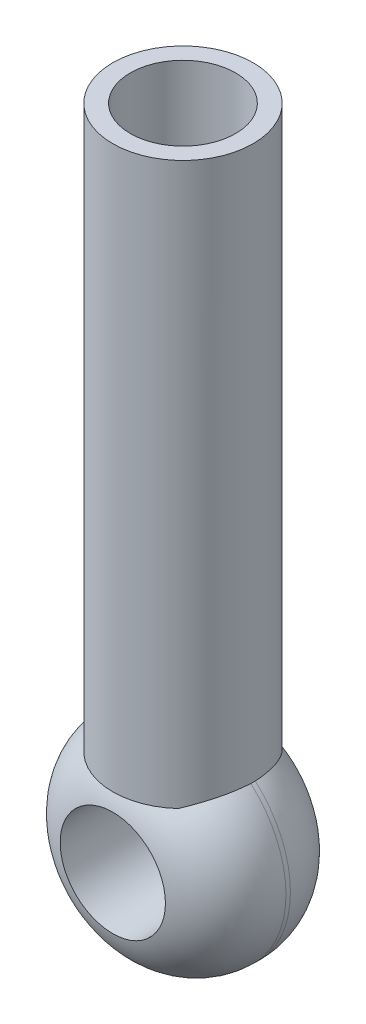
ISO-10303-21;
HEADER;
FILE_DESCRIPTION(('STEP AP214'),'2;1');
FILE_NAME('part.step','',(''),(''),'','','');
FILE_SCHEMA(('AUTOMOTIVE_DESIGN { 1 0 10303 214 1 1 1 1 }'));
ENDSEC;
DATA;
#1=APPLICATION_CONTEXT('core data for automotive mechanical design processes');
#2=APPLICATION_PROTOCOL_DEFINITION('international standard','automotive_design',2000,#1);
#3=PRODUCT_CONTEXT('',#1,'mechanical');
#4=PRODUCT('Part','Part','',(#3));
#5=PRODUCT_RELATED_PRODUCT_CATEGORY('part','',(#4));
#6=PRODUCT_DEFINITION_FORMATION('','',#4);
#7=PRODUCT_DEFINITION_CONTEXT('part definition',#1,'design');
#8=PRODUCT_DEFINITION('design','',#6,#7);
#9=PRODUCT_DEFINITION_SHAPE('','',#8);
#10=(LENGTH_UNIT() NAMED_UNIT(*) SI_UNIT(.MILLI.,.METRE.));
#11=(NAMED_UNIT(*) PLANE_ANGLE_UNIT() SI_UNIT($,.RADIAN.));
#12=(NAMED_UNIT(*) SI_UNIT($,.STERADIAN.) SOLID_ANGLE_UNIT());
#13=UNCERTAINTY_MEASURE_WITH_UNIT(LENGTH_MEASURE(1.E-05),#10,'distance_accuracy_value','');
#14=(GEOMETRIC_REPRESENTATION_CONTEXT(3) GLOBAL_UNCERTAINTY_ASSIGNED_CONTEXT((#13)) GLOBAL_UNIT_ASSIGNED_CONTEXT((#10,
#11,#12)) REPRESENTATION_CONTEXT('',''));
#15=CARTESIAN_POINT('',(0.,0.,0.));
#16=DIRECTION('',(0.,0.,1.));
#17=DIRECTION('',(1.,0.,0.));
#18=AXIS2_PLACEMENT_3D('',#15,#16,#17);
#19=CARTESIAN_POINT('',(0.,0.,20.));
#20=DIRECTION('',(0.,0.,-1.));
#21=DIRECTION('',(-1.,0.,0.));
#22=AXIS2_PLACEMENT_3D('',#19,#20,#21);
#23=CYLINDRICAL_SURFACE('',#22,15.);
#24=CARTESIAN_POINT('',(9.99495709397349,11.184848353448,10.3175416344815));
#25=CARTESIAN_POINT('',(9.9983190313245,11.181842709482,10.2116944229876));
#26=CARTESIAN_POINT('',(10.,11.180339887499,10.1058472114938));
#27=CARTESIAN_POINT('',(10.,11.180339887499,9.89415278850618));
#28=CARTESIAN_POINT('',(9.9983190313245,11.181842709482,9.78830557701236));
#29=CARTESIAN_POINT('',(9.99495709397349,11.184848353448,9.68245836551854));
#30=B_SPLINE_CURVE_WITH_KNOTS('',3,(#24,#25,#26,#27,#28,#29),.UNSPECIFIED.,.F.,.F.,(4,2,4),(0.,
0.317613675391285,0.635227350782569),.UNSPECIFIED.);
#31=CARTESIAN_POINT('',(9.99495709397349,11.184848353448,10.3175416344815));
#32=VERTEX_POINT('',#31);
#33=CARTESIAN_POINT('',(9.99495709397349,11.184848353448,9.68245836551854));
#34=VERTEX_POINT('',#33);
#35=EDGE_CURVE('E72',#32,#34,#30,.T.);
#36=ORIENTED_EDGE('',*,*,#35,.F.);
#37=CARTESIAN_POINT('',(0.,0.,10.3175416344815));
#38=DIRECTION('',(0.,0.,1.));
#39=DIRECTION('',(1.,0.,0.));
#40=AXIS2_PLACEMENT_3D('',#37,#38,#39);
#41=CIRCLE('',#40,15.);
#42=CARTESIAN_POINT('',(-9.99495709397349,11.184848353448,10.3175416344815));
#43=VERTEX_POINT('',#42);
#44=EDGE_CURVE('E104',#32,#43,#41,.F.);
#45=ORIENTED_EDGE('',*,*,#44,.T.);
#46=CARTESIAN_POINT('',(-9.99495709397349,11.184848353448,9.68245836551854));
#47=CARTESIAN_POINT('',(-9.9983190313245,11.181842709482,9.78830557701236));
#48=CARTESIAN_POINT('',(-10.,11.180339887499,9.89415278850618));
#49=CARTESIAN_POINT('',(-10.,11.180339887499,10.1058472114938));
#50=CARTESIAN_POINT('',(-9.9983190313245,11.181842709482,10.2116944229876));
#51=CARTESIAN_POINT('',(-9.99495709397349,11.184848353448,10.3175416344815));
#52=B_SPLINE_CURVE_WITH_KNOTS('',3,(#46,#47,#48,#49,#50,#51),.UNSPECIFIED.,.F.,.F.,(4,2,4),(0.,
0.317613675391285,0.635227350782569),.UNSPECIFIED.);
#53=CARTESIAN_POINT('',(-9.99495709397349,11.184848353448,9.68245836551854));
#54=VERTEX_POINT('',#53);
#55=EDGE_CURVE('E144',#54,#43,#52,.T.);
#56=ORIENTED_EDGE('',*,*,#55,.F.);
#57=CARTESIAN_POINT('',(0.,0.,9.68245836551854));
#58=DIRECTION('',(0.,0.,-1.));
#59=DIRECTION('',(-1.,0.,0.));
#60=AXIS2_PLACEMENT_3D('',#57,#58,#59);
#61=CIRCLE('',#60,15.);
#62=EDGE_CURVE('E94',#54,#34,#61,.F.);
#63=ORIENTED_EDGE('',*,*,#62,.T.);
#64=EDGE_LOOP('',(#36,#45,#56,#63));
#65=FACE_BOUND('',#64,.T.);
#66=ADVANCED_FACE('F43',(#65),#23,.T.);
#67=CARTESIAN_POINT('',(0.,0.,9.68245836551854));
#68=DIRECTION('',(0.,0.,-1.));
#69=DIRECTION('',(-1.,0.,0.));
#70=AXIS2_PLACEMENT_3D('',#67,#68,#69);
#71=DEGENERATE_TOROIDAL_SURFACE('',#70,5.,10.,.T.);
#72=CARTESIAN_POINT('',(0.,0.,0.));
#73=DIRECTION('',(0.,0.,1.));
#74=DIRECTION('',(1.,0.,0.));
#75=AXIS2_PLACEMENT_3D('',#72,#73,#74);
#76=CIRCLE('',#75,7.5);
#77=CARTESIAN_POINT('',(7.5,0.,0.));
#78=VERTEX_POINT('',#77);
#79=EDGE_CURVE('E115',#78,#78,#76,.T.);
#80=ORIENTED_EDGE('',*,*,#79,.T.);
#81=EDGE_LOOP('',(#80));
#82=FACE_BOUND('',#81,.T.);
#83=ORIENTED_EDGE('',*,*,#62,.F.);
#84=CARTESIAN_POINT('',(-9.99496344600743,11.1848426744848,9.68265836551855));
#85=CARTESIAN_POINT('',(-9.98671786566399,11.1922602757333,9.42169018971652));
#86=CARTESIAN_POINT('',(-9.96816907643758,11.1950858327142,9.16092715337411));
#87=CARTESIAN_POINT('',(-9.91075791175284,11.1916394674072,8.64174222547384));
#88=CARTESIAN_POINT('',(-9.87189831444325,11.1853687891103,8.38332001864989));
#89=CARTESIAN_POINT('',(-9.7742863833289,11.1638473013504,7.87135930206357));
#90=CARTESIAN_POINT('',(-9.71558741779881,11.1486205035146,7.6178095989937));
#91=CARTESIAN_POINT('',(-9.57883007494955,11.1093381040931,7.11669387969464));
#92=CARTESIAN_POINT('',(-9.50077196860422,11.085282626082,6.86912777976496));
#93=CARTESIAN_POINT('',(-9.32601525194219,11.0285034785032,6.38164389724023));
#94=CARTESIAN_POINT('',(-9.2293133626598,10.9957782837742,6.14172746868982));
#95=CARTESIAN_POINT('',(-9.01819073639723,10.9218639944428,5.6711732797249));
#96=CARTESIAN_POINT('',(-8.90376937691506,10.8806746024684,5.44053584564912));
#97=CARTESIAN_POINT('',(-8.65825935101766,10.7900653880867,4.98997373122002));
#98=CARTESIAN_POINT('',(-8.52716923399135,10.7406448492417,4.7700499855401));
#99=CARTESIAN_POINT('',(-8.24957380029892,10.6338740558408,4.34230136331528));
#100=CARTESIAN_POINT('',(-8.1030721499961,10.5765256862799,4.13447362735317));
#101=CARTESIAN_POINT('',(-7.76107553566134,10.4403310919475,3.68636089229922));
#102=CARTESIAN_POINT('',(-7.56199535959246,10.3595566492704,3.44937180964414));
#103=CARTESIAN_POINT('',(-7.24956123121886,10.2304259872081,3.11033647226274));
#104=CARTESIAN_POINT('',(-7.14321950229168,10.1860991799837,3.00016091176216));
#105=CARTESIAN_POINT('',(-6.9261759503583,10.0948644813799,2.78533552319565));
#106=CARTESIAN_POINT('',(-6.81547460178355,10.0479568706346,2.68068509674746));
#107=CARTESIAN_POINT('',(-6.70272768216613,9.9998,2.57885173179218));
#108=B_SPLINE_CURVE_WITH_KNOTS('',3,(#84,#85,#86,#87,#88,#89,#90,#91,#92,#93,#94,#95,#96,#97,
#98,#99,#100,#101,#102,#103,#104,#105,#106,#107),.UNSPECIFIED.,.F.,.F.,(4,2,2,2,2,2,2,2,2,2,2,
4),(0.,0.783356544086545,1.56660596729071,2.3477649857624,3.1289130708089,3.91019866540339,
4.69151171353899,5.47289280262134,6.25408842177927,7.21204052490003,7.69012820904673,
8.16816400874945),.UNSPECIFIED.);
#109=CARTESIAN_POINT('',(-6.70319595067423,10.,2.57927469536403));
#110=VERTEX_POINT('',#109);
#111=EDGE_CURVE('E161',#54,#110,#108,.T.);
#112=ORIENTED_EDGE('',*,*,#111,.T.);
#113=CARTESIAN_POINT('',(0.,10.,1.02220432767416));
#114=CARTESIAN_POINT('',(0.228184911378586,10.,1.02220593443839));
#115=CARTESIAN_POINT('',(0.456361512835846,10.,1.02670638081143));
#116=CARTESIAN_POINT('',(0.912356264782832,10.,1.0447950820463));
#117=CARTESIAN_POINT('',(1.14017439442626,10.,1.05838384717136));
#118=CARTESIAN_POINT('',(1.82270793061155,10.,1.11310436761138));
#119=CARTESIAN_POINT('',(2.27641389943107,10.,1.16819048743379));
#120=CARTESIAN_POINT('',(3.17587343005349,10.,1.31863603607809));
#121=CARTESIAN_POINT('',(3.62164541650951,10.,1.41388439569447));
#122=CARTESIAN_POINT('',(4.50113034575016,10.,1.64914059446113));
#123=CARTESIAN_POINT('',(4.93485392981718,10.,1.78910747699373));
#124=CARTESIAN_POINT('',(5.6123543484195,10.,2.05183419051931));
#125=CARTESIAN_POINT('',(5.86230112349569,10.,2.158833740643));
#126=CARTESIAN_POINT('',(6.35354668965034,10.,2.39106063231422));
#127=CARTESIAN_POINT('',(6.59484823608554,10.,2.51628210070246));
#128=CARTESIAN_POINT('',(7.06671540543503,10.,2.78541904456307));
#129=CARTESIAN_POINT('',(7.2972847006834,10.,2.9293280607423));
#130=CARTESIAN_POINT('',(7.74554082249349,10.,3.23605172437001));
#131=CARTESIAN_POINT('',(7.96322731821896,10.,3.39886685701854));
#132=CARTESIAN_POINT('',(8.38524455389905,10.,3.74476313047858));
#133=CARTESIAN_POINT('',(8.58943525527278,10.,3.9280156831348));
#134=CARTESIAN_POINT('',(8.97974822155679,10.,4.31290654605334));
#135=CARTESIAN_POINT('',(9.16586996334072,10.,4.5145453883017));
#136=CARTESIAN_POINT('',(9.51747937278361,10.,4.9350083220509));
#137=CARTESIAN_POINT('',(9.68297324091699,10.,5.15382721705752));
#138=CARTESIAN_POINT('',(9.99097910132118,10.,5.60708110277051));
#139=CARTESIAN_POINT('',(10.1334949325154,10.,5.84151347567757));
#140=CARTESIAN_POINT('',(10.3764496125823,10.,6.2925036411226));
#141=CARTESIAN_POINT('',(10.4799507467106,10.,6.50741636611151));
#142=CARTESIAN_POINT('',(10.6666737904827,10.,6.94587524319575));
#143=CARTESIAN_POINT('',(10.7498978753941,10.,7.16942046623639));
#144=CARTESIAN_POINT('',(10.8949864106893,10.,7.62320908490967));
#145=CARTESIAN_POINT('',(10.9568624249938,10.,7.85344878072783));
#146=CARTESIAN_POINT('',(11.0585181780084,10.,8.31875479662081));
#147=CARTESIAN_POINT('',(11.0982994218175,10.,8.55382078679628));
#148=CARTESIAN_POINT('',(11.1524887157037,10.,9.00372708492306));
#149=CARTESIAN_POINT('',(11.1689828940319,10.,9.21831865408176));
#150=CARTESIAN_POINT('',(11.1833606123922,10.,9.64812007382018));
#151=CARTESIAN_POINT('',(11.1812451543646,10.,9.86332989048989));
#152=CARTESIAN_POINT('',(11.1584295842413,10.,10.29270843567));
#153=CARTESIAN_POINT('',(11.1377338174454,10.,10.5068773958277));
#154=CARTESIAN_POINT('',(11.0779865315856,10.,10.9326395749265));
#155=CARTESIAN_POINT('',(11.038934914454,10.,11.1442327801004));
#156=CARTESIAN_POINT('',(10.9440277556455,10.,11.5583537422234));
#157=CARTESIAN_POINT('',(10.8885904908162,10.,11.7609775970696));
#158=CARTESIAN_POINT('',(10.7611481354538,10.,12.1610164430484));
#159=CARTESIAN_POINT('',(10.6891375077889,10.,12.3584296686928));
#160=CARTESIAN_POINT('',(10.529295533541,10.,12.7466434292682));
#161=CARTESIAN_POINT('',(10.4414705388769,10.,12.9374465826121));
#162=CARTESIAN_POINT('',(10.2507745202556,10.,13.3114739054499));
#163=CARTESIAN_POINT('',(10.1478969322421,10.,13.494694723534));
#164=CARTESIAN_POINT('',(9.92447387895717,10.,13.8583257653615));
#165=CARTESIAN_POINT('',(9.80346107692485,10.,14.0384487026991));
#166=CARTESIAN_POINT('',(9.54760580287419,10.,14.3884766927462));
#167=CARTESIAN_POINT('',(9.41276805298186,10.,14.5583852031039));
#168=CARTESIAN_POINT('',(9.13035313519826,10.,14.8874022738347));
#169=CARTESIAN_POINT('',(8.98276930590829,10.,15.0465051083668));
#170=CARTESIAN_POINT('',(8.67620066676089,10.,15.3532239908594));
#171=CARTESIAN_POINT('',(8.51721833321982,10.,15.5008425193336));
#172=CARTESIAN_POINT('',(8.17402001415071,10.,15.7972616200632));
#173=CARTESIAN_POINT('',(7.98882676860093,10.,15.9449305938168));
#174=CARTESIAN_POINT('',(7.60790022793673,10.,16.22594932625));
#175=CARTESIAN_POINT('',(7.41216656852636,10.,16.3592985895367));
#176=CARTESIAN_POINT('',(7.01172225229886,10.,16.6116553436292));
#177=CARTESIAN_POINT('',(6.80701296567608,10.,16.7306650131528));
#178=CARTESIAN_POINT('',(6.3900085117721,10.,16.954584061041));
#179=CARTESIAN_POINT('',(6.17771178377142,10.,17.0594905170289));
#180=CARTESIAN_POINT('',(5.63255324854738,10.,17.3075732086158));
#181=CARTESIAN_POINT('',(5.29546967416344,10.,17.4415337920882));
#182=CARTESIAN_POINT('',(4.61077194539427,10.,17.679160388845));
#183=CARTESIAN_POINT('',(4.26315310086176,10.,17.7828126840164));
#184=CARTESIAN_POINT('',(3.55946083537265,10.,17.9624257097318));
#185=CARTESIAN_POINT('',(3.20335972059636,10.,18.0382768256573));
#186=CARTESIAN_POINT('',(2.48664900004959,10.,18.1640076964507));
#187=CARTESIAN_POINT('',(2.12603943676951,10.,18.2138876958978));
#188=CARTESIAN_POINT('',(1.53049025184471,10.,18.2761201323106));
#189=CARTESIAN_POINT('',(1.29625267175929,10.,18.2955065482169));
#190=CARTESIAN_POINT('',(0.827155542843944,10.,18.32453264717));
#191=CARTESIAN_POINT('',(0.592295962979869,10.,18.3341718343383));
#192=CARTESIAN_POINT('',(0.122281519731942,10.,18.3438788731717));
#193=CARTESIAN_POINT('',(-0.112873427265454,10.,18.3439426004716));
#194=CARTESIAN_POINT('',(-0.582990128215762,10.,18.3344894792061));
#195=CARTESIAN_POINT('',(-0.817951882452919,10.,18.324972644762));
#196=CARTESIAN_POINT('',(-1.28680037957453,10.,18.2962157023187));
#197=CARTESIAN_POINT('',(-1.52068834228798,10.,18.276995894611));
#198=CARTESIAN_POINT('',(-1.98742340498473,10.,18.2285147470685));
#199=CARTESIAN_POINT('',(-2.22027037904179,10.,18.1992522239945));
#200=CARTESIAN_POINT('',(-2.91618515814013,10.,18.0957616084612));
#201=CARTESIAN_POINT('',(-3.37710727163384,10.,18.0058028696554));
#202=CARTESIAN_POINT('',(-4.12383726880842,10.,17.8199815687846));
#203=CARTESIAN_POINT('',(-4.41311331823179,10.,17.7378296192961));
#204=CARTESIAN_POINT('',(-4.98503409205493,10.,17.5530546218688));
#205=CARTESIAN_POINT('',(-5.26768082578432,10.,17.4504378687701));
#206=CARTESIAN_POINT('',(-5.82370555422569,10.,17.2237328176586));
#207=CARTESIAN_POINT('',(-6.09709852829454,10.,17.099681421206));
#208=CARTESIAN_POINT('',(-6.63254131423592,10.,16.8290775015625));
#209=CARTESIAN_POINT('',(-6.89459288558627,10.,16.6825284847545));
#210=CARTESIAN_POINT('',(-7.3623765154237,10.,16.3925415588841));
#211=CARTESIAN_POINT('',(-7.57026634691483,10.,16.2525810030849));
#212=CARTESIAN_POINT('',(-7.974296338439,10.,15.9566439867188));
#213=CARTESIAN_POINT('',(-8.17043885482274,10.,15.8006707552268));
#214=CARTESIAN_POINT('',(-8.54919556374907,10.,15.4728963771465));
#215=CARTESIAN_POINT('',(-8.73180408522973,10.,15.301088662434));
#216=CARTESIAN_POINT('',(-9.0814814674595,10.,14.9422886078762));
#217=CARTESIAN_POINT('',(-9.24855007679491,10.,14.7552960224529));
#218=CARTESIAN_POINT('',(-9.56623126955863,10.,14.3658369853666));
#219=CARTESIAN_POINT('',(-9.7167345484107,10.,14.1632811772351));
#220=CARTESIAN_POINT('',(-9.99822663235678,10.,13.7450036511074));
#221=CARTESIAN_POINT('',(-10.1292149680098,10.,13.5292816165675));
#222=CARTESIAN_POINT('',(-10.3699137012631,10.,13.0863861066141));
#223=CARTESIAN_POINT('',(-10.4796336973848,10.,12.8592178555382));
#224=CARTESIAN_POINT('',(-10.6763674703578,10.,12.3952589373693));
#225=CARTESIAN_POINT('',(-10.7633840692392,10.,12.1584694704254));
#226=CARTESIAN_POINT('',(-10.9049929382295,10.,11.7046956958556));
#227=CARTESIAN_POINT('',(-10.9621413310876,10.,11.4885056896751));
#228=CARTESIAN_POINT('',(-11.0569912591373,10.,11.0519023361277));
#229=CARTESIAN_POINT('',(-11.0946940895144,10.,10.8314892710552));
#230=CARTESIAN_POINT('',(-11.1502096628533,10.,10.3882486162712));
#231=CARTESIAN_POINT('',(-11.1680291567166,10.,10.1654218720264));
#232=CARTESIAN_POINT('',(-11.1835936591473,10.,9.71906822180106));
#233=CARTESIAN_POINT('',(-11.1813391261405,10.,9.49554133192611));
#234=CARTESIAN_POINT('',(-11.1574755669173,10.,9.06213319524539));
#235=CARTESIAN_POINT('',(-11.1369609636427,10.,8.852190813572));
#236=CARTESIAN_POINT('',(-11.0782805339622,10.,8.43471619531411));
#237=CARTESIAN_POINT('',(-11.0401089047147,10.,8.2271847740753));
#238=CARTESIAN_POINT('',(-10.9465276860542,10.,7.81616213613481));
#239=CARTESIAN_POINT('',(-10.8911268868537,10.,7.61266891536217));
#240=CARTESIAN_POINT('',(-10.7636119622712,10.,7.21089530106314));
#241=CARTESIAN_POINT('',(-10.6914904692195,10.,7.01261724851491));
#242=CARTESIAN_POINT('',(-10.5308151741855,10.,6.62155747578958));
#243=CARTESIAN_POINT('',(-10.4421726044565,10.,6.4288122643307));
#244=CARTESIAN_POINT('',(-10.2496183782775,10.,6.05121017832857));
#245=CARTESIAN_POINT('',(-10.1457126162914,10.,5.86635029396938));
#246=CARTESIAN_POINT('',(-9.9235340525224,10.,5.5053877776923));
#247=CARTESIAN_POINT('',(-9.80525569468146,10.,5.32928856972896));
#248=CARTESIAN_POINT('',(-9.55545761841681,10.,4.98683040044326));
#249=CARTESIAN_POINT('',(-9.42394117121948,10.,4.82046904881824));
#250=CARTESIAN_POINT('',(-9.14042578645627,10.,4.48836920067566));
#251=CARTESIAN_POINT('',(-8.98766890775205,10.,4.32327791825825));
#252=CARTESIAN_POINT('',(-8.66987332201554,10.,4.00539816424218));
#253=CARTESIAN_POINT('',(-8.50483444285492,10.,3.85260986512842));
#254=CARTESIAN_POINT('',(-8.16380804510362,10.,3.55969342608737));
#255=CARTESIAN_POINT('',(-7.9878171921604,10.,3.41956917391382));
#256=CARTESIAN_POINT('',(-7.62628398297603,10.,3.15221696889244));
#257=CARTESIAN_POINT('',(-7.44073982854864,10.,3.02499145741121));
#258=CARTESIAN_POINT('',(-6.98602465088484,10.,2.73546364344642));
#259=CARTESIAN_POINT('',(-6.7129194142353,10.,2.57931074092619));
#260=CARTESIAN_POINT('',(-6.15396987002616,10.,2.29174729928855));
#261=CARTESIAN_POINT('',(-5.86812126022719,10.,2.1603451956265));
#262=CARTESIAN_POINT('',(-5.28645043357677,10.,1.92118679958738));
#263=CARTESIAN_POINT('',(-4.9906194851268,10.,1.81345186177644));
#264=CARTESIAN_POINT('',(-4.3917224791518,10.,1.62039682512617));
#265=CARTESIAN_POINT('',(-4.08865494613438,10.,1.53508134078147));
#266=CARTESIAN_POINT('',(-3.47433372856311,10.,1.38461240702548));
#267=CARTESIAN_POINT('',(-3.16302816066747,10.,1.31967257144775));
#268=CARTESIAN_POINT('',(-2.53696816926246,10.,1.20963012009678));
#269=CARTESIAN_POINT('',(-2.22221376785696,10.,1.16452737726206));
#270=CARTESIAN_POINT('',(-1.59005901643911,10.,1.09283387342807));
#271=CARTESIAN_POINT('',(-1.27265494113864,10.,1.06627636321906));
#272=CARTESIAN_POINT('',(-0.6368285847724,10.,1.03095955299553));
#273=CARTESIAN_POINT('',(-0.318406202244898,10.,1.02220208561663));
#274=CARTESIAN_POINT('',(0.,10.,1.02220432767416));
#275=B_SPLINE_CURVE_WITH_KNOTS('',3,(#113,#114,#115,#116,#117,#118,#119,#120,#121,#122,#123,
#124,#125,#126,#127,#128,#129,#130,#131,#132,#133,#134,#135,#136,#137,#138,#139,#140,#141,#142,
#143,#144,#145,#146,#147,#148,#149,#150,#151,#152,#153,#154,#155,#156,#157,#158,#159,#160,#161,
#162,#163,#164,#165,#166,#167,#168,#169,#170,#171,#172,#173,#174,#175,#176,#177,#178,#179,#180,
#181,#182,#183,#184,#185,#186,#187,#188,#189,#190,#191,#192,#193,#194,#195,#196,#197,#198,#199,
#200,#201,#202,#203,#204,#205,#206,#207,#208,#209,#210,#211,#212,#213,#214,#215,#216,#217,#218,
#219,#220,#221,#222,#223,#224,#225,#226,#227,#228,#229,#230,#231,#232,#233,#234,#235,#236,#237,
#238,#239,#240,#241,#242,#243,#244,#245,#246,#247,#248,#249,#250,#251,#252,#253,#254,#255,#256,
#257,#258,#259,#260,#261,#262,#263,#264,#265,#266,#267,#268,#269,#270,#271,#272,#273,#274),
.UNSPECIFIED.,.T.,.F.,(4,2,2,2,2,2,2,2,2,2,2,2,2,2,2,2,2,2,2,2,2,2,2,2,2,2,2,2,2,2,2,2,2,2,2,2,
2,2,2,2,2,2,2,2,2,2,2,2,2,2,2,2,2,2,2,2,2,2,2,2,2,2,2,2,2,2,2,2,2,2,2,2,2,2,2,2,2,2,2,2,4),(0.,
0.68448654187541,1.36901151744101,2.73832646607074,4.1038791389516,5.46818470312325,
6.28320568453337,7.09796455363902,7.91244254975279,8.72694145297026,9.548874609606,
10.3708315554778,11.1925408327315,12.0141126850595,12.7287495553852,13.4433097275879,
14.1574822236056,14.8716060641207,15.5164910261491,16.1613412678682,16.8060407404001,
17.4507436573288,18.0802331744468,18.7099333090051,19.3393810832763,19.9691041664713,
20.6193963583518,21.2694671681302,21.9198798001425,22.5701515561833,23.2800201693041,
23.9899133325457,24.699698500229,25.4096305190464,26.4961223680433,27.5831052255753,
28.6743288786398,29.7655422550833,30.4704740685975,31.1754417428671,31.8807130616547,
32.5859833409069,33.2897841506092,33.9936679110683,35.3999963415392,36.3015093693108,
37.2027455240682,38.102445307969,39.0020050105952,39.7531196891541,40.5040831962796,
41.2553596162654,42.0066481887232,42.7626294097449,43.5186288133101,44.2742862316491,
45.0298496770477,45.6998393615501,46.3697844151476,47.0395019359781,47.7092041626643,
48.3412834823295,48.9735706776022,49.6055358117448,50.237779940865,50.8735245298957,
51.5090242442459,52.1447704118957,52.780359866005,53.4544210753328,54.1284917331944,
54.8027686270027,55.4771729050242,56.4195507594999,57.36224921209,58.3057947867445,
59.2495344152705,60.202860749538,61.1561809774256,62.1112061082233,63.0663295603814),.UNSPECIFIED.);
#276=CARTESIAN_POINT('',(6.70319595067421,10.,2.57927469536401));
#277=VERTEX_POINT('',#276);
#278=EDGE_CURVE('E137',#110,#277,#275,.T.);
#279=ORIENTED_EDGE('',*,*,#278,.T.);
#280=CARTESIAN_POINT('',(6.70272768216613,9.9998,2.57885173179218));
#281=CARTESIAN_POINT('',(6.80862629601882,10.0450316066384,2.67449881356884));
#282=CARTESIAN_POINT('',(6.91272270071631,10.0891623802332,2.77263449174357));
#283=CARTESIAN_POINT('',(7.11708232620054,10.1751509690935,2.9737845228429));
#284=CARTESIAN_POINT('',(7.21734531256485,10.2170086454194,3.07679917326834));
#285=CARTESIAN_POINT('',(7.51206939493112,10.3390766726868,3.39304680378638));
#286=CARTESIAN_POINT('',(7.70041413955121,10.4157600614902,3.61343707685869));
#287=CARTESIAN_POINT('',(8.05893731111778,10.5592287812411,4.07222809400501));
#288=CARTESIAN_POINT('',(8.22908006009656,10.6259947689412,4.3106627005194));
#289=CARTESIAN_POINT('',(8.54880434942239,10.7489631297549,4.80344759012541));
#290=CARTESIAN_POINT('',(8.69839167823092,10.8051684784175,5.05779336310881));
#291=CARTESIAN_POINT('',(8.96502910522847,10.9028728605945,5.56115988045559));
#292=CARTESIAN_POINT('',(9.08366481131862,10.9451505366593,5.80919116550009));
#293=CARTESIAN_POINT('',(9.30052275915645,11.0200180531921,6.31542647068876));
#294=CARTESIAN_POINT('',(9.39874656431399,11.0526086357066,6.57362970992851));
#295=CARTESIAN_POINT('',(9.57348132052404,11.1077914196958,7.097502330927));
#296=CARTESIAN_POINT('',(9.6500525315933,11.1304114697106,7.36314868455247));
#297=CARTESIAN_POINT('',(9.78100282194715,11.1655920459283,7.90038766790575));
#298=CARTESIAN_POINT('',(9.8353934179161,11.1781577958238,8.17197713444815));
#299=CARTESIAN_POINT('',(9.9106545251346,11.1912307649124,8.65022122135583));
#300=CARTESIAN_POINT('',(9.93651343821898,11.1939744312722,8.85604653713257));
#301=CARTESIAN_POINT('',(9.97538302570313,11.19371862304,9.26875236874051));
#302=CARTESIAN_POINT('',(9.98840299704972,11.1907233087965,9.47563201183325));
#303=CARTESIAN_POINT('',(9.99496344600743,11.1848426744848,9.68265836551855));
#304=B_SPLINE_CURVE_WITH_KNOTS('',3,(#280,#281,#282,#283,#284,#285,#286,#287,#288,#289,#290,
#291,#292,#293,#294,#295,#296,#297,#298,#299,#300,#301,#302,#303),.UNSPECIFIED.,.F.,.F.,(4,2,2,
2,2,2,2,2,2,2,2,4),(0.,0.449014267336088,0.898055949162256,1.79635660039147,2.69638694975387,
3.59616332647118,4.42961537254838,5.26300355843959,6.09404903811557,6.92466246882521,
7.54658804562046,8.16806294163763),.UNSPECIFIED.);
#305=EDGE_CURVE('E174',#277,#34,#304,.T.);
#306=ORIENTED_EDGE('',*,*,#305,.T.);
#307=EDGE_LOOP('',(#83,#112,#279,#306));
#308=FACE_BOUND('',#307,.T.);
#309=ADVANCED_FACE('F153',(#82,#308),#71,.T.);
#310=CARTESIAN_POINT('',(0.,0.,10.3175416344815));
#311=DIRECTION('',(0.,0.,1.));
#312=DIRECTION('',(1.,0.,0.));
#313=AXIS2_PLACEMENT_3D('',#310,#311,#312);
#314=DEGENERATE_TOROIDAL_SURFACE('',#313,5.,10.,.T.);
#315=CARTESIAN_POINT('',(0.,0.,20.));
#316=DIRECTION('',(0.,0.,1.));
#317=DIRECTION('',(1.,0.,0.));
#318=AXIS2_PLACEMENT_3D('',#315,#316,#317);
#319=CIRCLE('',#318,7.5);
#320=CARTESIAN_POINT('',(7.5,0.,20.));
#321=VERTEX_POINT('',#320);
#322=EDGE_CURVE('E108',#321,#321,#319,.T.);
#323=ORIENTED_EDGE('',*,*,#322,.F.);
#324=EDGE_LOOP('',(#323));
#325=FACE_BOUND('',#324,.T.);
#326=ORIENTED_EDGE('',*,*,#44,.F.);
#327=CARTESIAN_POINT('',(9.99496344600743,11.1848426744848,10.3173416344814));
#328=CARTESIAN_POINT('',(9.98671786566399,11.1922602757333,10.5783098102835));
#329=CARTESIAN_POINT('',(9.96816907643758,11.1950858327142,10.8390728466259));
#330=CARTESIAN_POINT('',(9.91075791175284,11.1916394674072,11.3582577745262));
#331=CARTESIAN_POINT('',(9.87189831444325,11.1853687891103,11.6166799813501));
#332=CARTESIAN_POINT('',(9.7742863833289,11.1638473013504,12.1286406979364));
#333=CARTESIAN_POINT('',(9.71558741779881,11.1486205035146,12.3821904010063));
#334=CARTESIAN_POINT('',(9.57883007494955,11.1093381040931,12.8833061203054));
#335=CARTESIAN_POINT('',(9.50077196860422,11.085282626082,13.130872220235));
#336=CARTESIAN_POINT('',(9.32601525194219,11.0285034785032,13.6183561027598));
#337=CARTESIAN_POINT('',(9.2293133626598,10.9957782837742,13.8582725313102));
#338=CARTESIAN_POINT('',(9.01819073639723,10.9218639944428,14.3288267202751));
#339=CARTESIAN_POINT('',(8.90376937691506,10.8806746024684,14.5594641543509));
#340=CARTESIAN_POINT('',(8.65825935101766,10.7900653880867,15.01002626878));
#341=CARTESIAN_POINT('',(8.52716923399135,10.7406448492417,15.2299500144599));
#342=CARTESIAN_POINT('',(8.24957380029892,10.6338740558408,15.6576986366847));
#343=CARTESIAN_POINT('',(8.1030721499961,10.5765256862798,15.8655263726468));
#344=CARTESIAN_POINT('',(7.76107553566134,10.4403310919475,16.3136391077008));
#345=CARTESIAN_POINT('',(7.56199535959247,10.3595566492704,16.5506281903559));
#346=CARTESIAN_POINT('',(7.24956123121886,10.2304259872081,16.8896635277373));
#347=CARTESIAN_POINT('',(7.14321950229169,10.1860991799837,16.9998390882378));
#348=CARTESIAN_POINT('',(6.92617595035831,10.0948644813799,17.2146644768043));
#349=CARTESIAN_POINT('',(6.81547460178356,10.0479568706346,17.3193149032525));
#350=CARTESIAN_POINT('',(6.70272768216614,9.9998,17.4211482682078));
#351=B_SPLINE_CURVE_WITH_KNOTS('',3,(#327,#328,#329,#330,#331,#332,#333,#334,#335,#336,#337,
#338,#339,#340,#341,#342,#343,#344,#345,#346,#347,#348,#349,#350),.UNSPECIFIED.,.F.,.F.,(4,2,2,
2,2,2,2,2,2,2,2,4),(0.,0.783356544086549,1.56660596729071,2.34776498576241,3.1289130708089,
3.9101986654034,4.691511713539,5.47289280262134,6.25408842177928,7.21204052490003,
7.69012820904673,8.16816400874944),.UNSPECIFIED.);
#352=CARTESIAN_POINT('',(6.70319595065178,10.,17.4207253046563));
#353=VERTEX_POINT('',#352);
#354=EDGE_CURVE('E11',#32,#353,#351,.T.);
#355=ORIENTED_EDGE('',*,*,#354,.T.);
#356=CARTESIAN_POINT('',(0.,10.,18.9777956723258));
#357=CARTESIAN_POINT('',(-0.228184911378587,10.,18.9777940655616));
#358=CARTESIAN_POINT('',(-0.456361512835847,10.,18.9732936191886));
#359=CARTESIAN_POINT('',(-0.912356264782832,10.,18.9552049179537));
#360=CARTESIAN_POINT('',(-1.14017439442626,10.,18.9416161528286));
#361=CARTESIAN_POINT('',(-1.82270793061155,10.,18.8868956323886));
#362=CARTESIAN_POINT('',(-2.27641389943107,10.,18.8318095125662));
#363=CARTESIAN_POINT('',(-3.17587343005349,10.,18.6813639639219));
#364=CARTESIAN_POINT('',(-3.62164541650952,10.,18.5861156043055));
#365=CARTESIAN_POINT('',(-4.50113034575016,10.,18.3508594055389));
#366=CARTESIAN_POINT('',(-4.93485392981718,10.,18.2108925230063));
#367=CARTESIAN_POINT('',(-5.6123543484195,10.,17.9481658094807));
#368=CARTESIAN_POINT('',(-5.86230112349569,10.,17.841166259357));
#369=CARTESIAN_POINT('',(-6.35354668965034,10.,17.6089393676858));
#370=CARTESIAN_POINT('',(-6.59484823608554,10.,17.4837178992975));
#371=CARTESIAN_POINT('',(-7.06671540543504,10.,17.2145809554369));
#372=CARTESIAN_POINT('',(-7.29728470068341,10.,17.0706719392577));
#373=CARTESIAN_POINT('',(-7.7455408224935,10.,16.76394827563));
#374=CARTESIAN_POINT('',(-7.96322731821896,10.,16.6011331429815));
#375=CARTESIAN_POINT('',(-8.38524455389906,10.,16.2552368695214));
#376=CARTESIAN_POINT('',(-8.58943525527278,10.,16.0719843168652));
#377=CARTESIAN_POINT('',(-8.97974822155679,10.,15.6870934539467));
#378=CARTESIAN_POINT('',(-9.16586996334072,10.,15.4854546116983));
#379=CARTESIAN_POINT('',(-9.51747937278361,10.,15.0649916779491));
#380=CARTESIAN_POINT('',(-9.68297324091699,10.,14.8461727829425));
#381=CARTESIAN_POINT('',(-9.99097910132118,10.,14.3929188972295));
#382=CARTESIAN_POINT('',(-10.1334949325154,10.,14.1584865243224));
#383=CARTESIAN_POINT('',(-10.3764496125823,10.,13.7074963588774));
#384=CARTESIAN_POINT('',(-10.4799507467106,10.,13.4925836338885));
#385=CARTESIAN_POINT('',(-10.6666737904827,10.,13.0541247568042));
#386=CARTESIAN_POINT('',(-10.7498978753941,10.,12.8305795337636));
#387=CARTESIAN_POINT('',(-10.8949864106893,10.,12.3767909150903));
#388=CARTESIAN_POINT('',(-10.9568624249938,10.,12.1465512192722));
#389=CARTESIAN_POINT('',(-11.0585181780084,10.,11.6812452033792));
#390=CARTESIAN_POINT('',(-11.0982994218175,10.,11.4461792132037));
#391=CARTESIAN_POINT('',(-11.1524887157037,10.,10.9962729150769));
#392=CARTESIAN_POINT('',(-11.1689828940319,10.,10.7816813459182));
#393=CARTESIAN_POINT('',(-11.1833606123922,10.,10.3518799261798));
#394=CARTESIAN_POINT('',(-11.1812451543646,10.,10.1366701095101));
#395=CARTESIAN_POINT('',(-11.1584295842413,10.,9.70729156432995));
#396=CARTESIAN_POINT('',(-11.1377338174454,10.,9.49312260417231));
#397=CARTESIAN_POINT('',(-11.0779865315856,10.,9.06736042507347));
#398=CARTESIAN_POINT('',(-11.038934914454,10.,8.85576721989962));
#399=CARTESIAN_POINT('',(-10.9440277556455,10.,8.44164625777663));
#400=CARTESIAN_POINT('',(-10.8885904908162,10.,8.23902240293035));
#401=CARTESIAN_POINT('',(-10.7611481354538,10.,7.83898355695155));
#402=CARTESIAN_POINT('',(-10.6891375077889,10.,7.64157033130724));
#403=CARTESIAN_POINT('',(-10.529295533541,10.,7.25335657073176));
#404=CARTESIAN_POINT('',(-10.4414705388769,10.,7.0625534173879));
#405=CARTESIAN_POINT('',(-10.2507745202556,10.,6.68852609455011));
#406=CARTESIAN_POINT('',(-10.1478969322421,10.,6.50530527646601));
#407=CARTESIAN_POINT('',(-9.92447387895716,10.,6.14167423463846));
#408=CARTESIAN_POINT('',(-9.80346107692485,10.,5.96155129730092));
#409=CARTESIAN_POINT('',(-9.54760580287418,10.,5.61152330725383));
#410=CARTESIAN_POINT('',(-9.41276805298185,10.,5.44161479689613));
#411=CARTESIAN_POINT('',(-9.13035313519825,10.,5.11259772616533));
#412=CARTESIAN_POINT('',(-8.98276930590828,10.,4.95349489163317));
#413=CARTESIAN_POINT('',(-8.67620066676089,10.,4.64677600914058));
#414=CARTESIAN_POINT('',(-8.51721833321982,10.,4.49915748066634));
#415=CARTESIAN_POINT('',(-8.1740200141507,10.,4.20273837993676));
#416=CARTESIAN_POINT('',(-7.98882676860092,10.,4.05506940618314));
#417=CARTESIAN_POINT('',(-7.60790022793672,10.,3.77405067374997));
#418=CARTESIAN_POINT('',(-7.41216656852636,10.,3.64070141046325));
#419=CARTESIAN_POINT('',(-7.01172225229885,10.,3.38834465637076));
#420=CARTESIAN_POINT('',(-6.80701296567607,10.,3.26933498684717));
#421=CARTESIAN_POINT('',(-6.39000851177209,10.,3.045415938959));
#422=CARTESIAN_POINT('',(-6.17771178377141,10.,2.94050948297107));
#423=CARTESIAN_POINT('',(-5.63255324854737,10.,2.69242679138414));
#424=CARTESIAN_POINT('',(-5.29546967416343,10.,2.55846620791177));
#425=CARTESIAN_POINT('',(-4.61077194539426,10.,2.32083961115497));
#426=CARTESIAN_POINT('',(-4.26315310086175,10.,2.21718731598357));
#427=CARTESIAN_POINT('',(-3.55946083537264,10.,2.03757429026817));
#428=CARTESIAN_POINT('',(-3.20335972059635,10.,1.96172317434274));
#429=CARTESIAN_POINT('',(-2.48664900004958,10.,1.83599230354932));
#430=CARTESIAN_POINT('',(-2.1260394367695,10.,1.78611230410223));
#431=CARTESIAN_POINT('',(-1.5304902518447,10.,1.72387986768936));
#432=CARTESIAN_POINT('',(-1.29625267175928,10.,1.70449345178312));
#433=CARTESIAN_POINT('',(-0.827155542843933,10.,1.67546735283003));
#434=CARTESIAN_POINT('',(-0.592295962979857,10.,1.66582816566174));
#435=CARTESIAN_POINT('',(-0.122281519731928,10.,1.65612112682828));
#436=CARTESIAN_POINT('',(0.112873427265468,10.,1.65605739952842));
#437=CARTESIAN_POINT('',(0.582990128215778,10.,1.66551052079393));
#438=CARTESIAN_POINT('',(0.817951882452937,10.,1.67502735523798));
#439=CARTESIAN_POINT('',(1.28680037957455,10.,1.70378429768132));
#440=CARTESIAN_POINT('',(1.520688342288,10.,1.72300410538903));
#441=CARTESIAN_POINT('',(1.98742340498475,10.,1.77148525293149));
#442=CARTESIAN_POINT('',(2.2202703790418,10.,1.80074777600554));
#443=CARTESIAN_POINT('',(2.91618515814015,10.,1.90423839153884));
#444=CARTESIAN_POINT('',(3.37710727163386,10.,1.99419713034463));
#445=CARTESIAN_POINT('',(4.12383726880843,10.,2.18001843121542));
#446=CARTESIAN_POINT('',(4.41311331823181,10.,2.26217038070385));
#447=CARTESIAN_POINT('',(4.98503409205494,10.,2.44694537813116));
#448=CARTESIAN_POINT('',(5.26768082578433,10.,2.54956213122991));
#449=CARTESIAN_POINT('',(5.8237055542257,10.,2.77626718234144));
#450=CARTESIAN_POINT('',(6.09709852829455,10.,2.90031857879395));
#451=CARTESIAN_POINT('',(6.63254131423593,10.,3.17092249843754));
#452=CARTESIAN_POINT('',(6.89459288558628,10.,3.31747151524553));
#453=CARTESIAN_POINT('',(7.36237651542371,10.,3.60745844111594));
#454=CARTESIAN_POINT('',(7.57026634691484,10.,3.74741899691506));
#455=CARTESIAN_POINT('',(7.97429633843902,10.,4.04335601328117));
#456=CARTESIAN_POINT('',(8.17043885482275,10.,4.19932924477319));
#457=CARTESIAN_POINT('',(8.54919556374908,10.,4.52710362285349));
#458=CARTESIAN_POINT('',(8.73180408522974,10.,4.69891133756599));
#459=CARTESIAN_POINT('',(9.08148146745951,10.,5.05771139212382));
#460=CARTESIAN_POINT('',(9.24855007679492,10.,5.24470397754714));
#461=CARTESIAN_POINT('',(9.56623126955864,10.,5.63416301463344));
#462=CARTESIAN_POINT('',(9.71673454841071,10.,5.83671882276489));
#463=CARTESIAN_POINT('',(9.99822663235678,10.,6.25499634889255));
#464=CARTESIAN_POINT('',(10.1292149680098,10.,6.47071838343253));
#465=CARTESIAN_POINT('',(10.3699137012631,10.,6.9136138933859));
#466=CARTESIAN_POINT('',(10.4796336973848,10.,7.1407821444618));
#467=CARTESIAN_POINT('',(10.6763674703578,10.,7.60474106263066));
#468=CARTESIAN_POINT('',(10.7633840692392,10.,7.8415305295746));
#469=CARTESIAN_POINT('',(10.9049929382295,10.,8.29530430414435));
#470=CARTESIAN_POINT('',(10.9621413310876,10.,8.51149431032495));
#471=CARTESIAN_POINT('',(11.0569912591373,10.,8.94809766387231));
#472=CARTESIAN_POINT('',(11.0946940895144,10.,9.16851072894475));
#473=CARTESIAN_POINT('',(11.1502096628533,10.,9.61175138372877));
#474=CARTESIAN_POINT('',(11.1680291567166,10.,9.83457812797358));
#475=CARTESIAN_POINT('',(11.1835936591473,10.,10.2809317781989));
#476=CARTESIAN_POINT('',(11.1813391261405,10.,10.5044586680739));
#477=CARTESIAN_POINT('',(11.1574755669173,10.,10.9378668047546));
#478=CARTESIAN_POINT('',(11.1369609636427,10.,11.147809186428));
#479=CARTESIAN_POINT('',(11.0782805339622,10.,11.5652838046859));
#480=CARTESIAN_POINT('',(11.0401089047147,10.,11.7728152259247));
#481=CARTESIAN_POINT('',(10.9465276860542,10.,12.1838378638652));
#482=CARTESIAN_POINT('',(10.8911268868537,10.,12.3873310846378));
#483=CARTESIAN_POINT('',(10.7636119622712,10.,12.7891046989369));
#484=CARTESIAN_POINT('',(10.6914904692195,10.,12.9873827514851));
#485=CARTESIAN_POINT('',(10.5308151741855,10.,13.3784425242104));
#486=CARTESIAN_POINT('',(10.4421726044565,10.,13.5711877356693));
#487=CARTESIAN_POINT('',(10.2496183782775,10.,13.9487898216714));
#488=CARTESIAN_POINT('',(10.1457126162914,10.,14.1336497060306));
#489=CARTESIAN_POINT('',(9.9235340525224,10.,14.4946122223077));
#490=CARTESIAN_POINT('',(9.80525569468146,10.,14.670711430271));
#491=CARTESIAN_POINT('',(9.55545761841681,10.,15.0131695995567));
#492=CARTESIAN_POINT('',(9.42394117121947,10.,15.1795309511818));
#493=CARTESIAN_POINT('',(9.14042578645627,10.,15.5116307993243));
#494=CARTESIAN_POINT('',(8.98766890775204,10.,15.6767220817417));
#495=CARTESIAN_POINT('',(8.66987332201554,10.,15.9946018357578));
#496=CARTESIAN_POINT('',(8.50483444285492,10.,16.1473901348716));
#497=CARTESIAN_POINT('',(8.16380804510362,10.,16.4403065739126));
#498=CARTESIAN_POINT('',(7.9878171921604,10.,16.5804308260862));
#499=CARTESIAN_POINT('',(7.62628398297603,10.,16.8477830311076));
#500=CARTESIAN_POINT('',(7.44073982854864,10.,16.9750085425888));
#501=CARTESIAN_POINT('',(6.98602465088484,10.,17.2645363565536));
#502=CARTESIAN_POINT('',(6.7129194142353,10.,17.4206892590738));
#503=CARTESIAN_POINT('',(6.15396987002616,10.,17.7082527007114));
#504=CARTESIAN_POINT('',(5.86812126022719,10.,17.8396548043735));
#505=CARTESIAN_POINT('',(5.28645043357676,10.,18.0788132004126));
#506=CARTESIAN_POINT('',(4.99061948512679,10.,18.1865481382236));
#507=CARTESIAN_POINT('',(4.3917224791518,10.,18.3796031748738));
#508=CARTESIAN_POINT('',(4.08865494613438,10.,18.4649186592185));
#509=CARTESIAN_POINT('',(3.4743337285631,10.,18.6153875929745));
#510=CARTESIAN_POINT('',(3.16302816066746,10.,18.6803274285522));
#511=CARTESIAN_POINT('',(2.53696816926246,10.,18.7903698799032));
#512=CARTESIAN_POINT('',(2.22221376785696,10.,18.8354726227379));
#513=CARTESIAN_POINT('',(1.59005901643911,10.,18.9071661265719));
#514=CARTESIAN_POINT('',(1.27265494113864,10.,18.9337236367809));
#515=CARTESIAN_POINT('',(0.636828584772397,10.,18.9690404470045));
#516=CARTESIAN_POINT('',(0.318406202244897,10.,18.9777979143834));
#517=CARTESIAN_POINT('',(0.,10.,18.9777956723258));
#518=B_SPLINE_CURVE_WITH_KNOTS('',3,(#356,#357,#358,#359,#360,#361,#362,#363,#364,#365,#366,
#367,#368,#369,#370,#371,#372,#373,#374,#375,#376,#377,#378,#379,#380,#381,#382,#383,#384,#385,
#386,#387,#388,#389,#390,#391,#392,#393,#394,#395,#396,#397,#398,#399,#400,#401,#402,#403,#404,
#405,#406,#407,#408,#409,#410,#411,#412,#413,#414,#415,#416,#417,#418,#419,#420,#421,#422,#423,
#424,#425,#426,#427,#428,#429,#430,#431,#432,#433,#434,#435,#436,#437,#438,#439,#440,#441,#442,
#443,#444,#445,#446,#447,#448,#449,#450,#451,#452,#453,#454,#455,#456,#457,#458,#459,#460,#461,
#462,#463,#464,#465,#466,#467,#468,#469,#470,#471,#472,#473,#474,#475,#476,#477,#478,#479,#480,
#481,#482,#483,#484,#485,#486,#487,#488,#489,#490,#491,#492,#493,#494,#495,#496,#497,#498,#499,
#500,#501,#502,#503,#504,#505,#506,#507,#508,#509,#510,#511,#512,#513,#514,#515,#516,#517),
.UNSPECIFIED.,.T.,.F.,(4,2,2,2,2,2,2,2,2,2,2,2,2,2,2,2,2,2,2,2,2,2,2,2,2,2,2,2,2,2,2,2,2,2,2,2,
2,2,2,2,2,2,2,2,2,2,2,2,2,2,2,2,2,2,2,2,2,2,2,2,2,2,2,2,2,2,2,2,2,2,2,2,2,2,2,2,2,2,2,2,4),(0.,
0.684486541875411,1.36901151744101,2.73832646607074,4.1038791389516,5.46818470312325,
6.28320568453337,7.09796455363902,7.91244254975279,8.72694145297027,9.548874609606,
10.3708315554778,11.1925408327315,12.0141126850595,12.7287495553852,13.4433097275879,
14.1574822236056,14.8716060641207,15.5164910261491,16.1613412678682,16.8060407404001,
17.4507436573288,18.0802331744468,18.7099333090051,19.3393810832763,19.9691041664713,
20.6193963583518,21.2694671681303,21.9198798001425,22.5701515561833,23.2800201693041,
23.9899133325457,24.699698500229,25.4096305190464,26.4961223680433,27.5831052255753,
28.6743288786398,29.7655422550833,30.4704740685975,31.1754417428671,31.8807130616547,
32.5859833409069,33.2897841506092,33.9936679110683,35.3999963415392,36.3015093693109,
37.2027455240682,38.102445307969,39.0020050105953,39.7531196891541,40.5040831962796,
41.2553596162654,42.0066481887232,42.7626294097449,43.5186288133101,44.2742862316491,
45.0298496770477,45.6998393615501,46.3697844151476,47.0395019359781,47.7092041626644,
48.3412834823295,48.9735706776022,49.6055358117448,50.237779940865,50.8735245298957,
51.5090242442459,52.1447704118957,52.780359866005,53.4544210753328,54.1284917331944,
54.8027686270027,55.4771729050242,56.4195507594999,57.36224921209,58.3057947867445,
59.2495344152705,60.2028607495381,61.1561809774256,62.1112061082233,63.0663295603814),.UNSPECIFIED.);
#519=CARTESIAN_POINT('',(-6.70319595067898,10.,17.4207253046412));
#520=VERTEX_POINT('',#519);
#521=EDGE_CURVE('E89',#353,#520,#518,.T.);
#522=ORIENTED_EDGE('',*,*,#521,.T.);
#523=CARTESIAN_POINT('',(-6.70272768216614,9.9998,17.4211482682078));
#524=CARTESIAN_POINT('',(-6.80862629601883,10.0450316066384,17.3255011864312));
#525=CARTESIAN_POINT('',(-6.91272270071632,10.0891623802332,17.2273655082564));
#526=CARTESIAN_POINT('',(-7.11708232620055,10.1751509690935,17.0262154771571));
#527=CARTESIAN_POINT('',(-7.21734531256486,10.2170086454194,16.9232008267317));
#528=CARTESIAN_POINT('',(-7.51206939493113,10.3390766726868,16.6069531962136));
#529=CARTESIAN_POINT('',(-7.70041413955122,10.4157600614902,16.3865629231413));
#530=CARTESIAN_POINT('',(-8.05893731111779,10.5592287812411,15.927771905995));
#531=CARTESIAN_POINT('',(-8.22908006009656,10.6259947689412,15.6893372994806));
#532=CARTESIAN_POINT('',(-8.5488043494224,10.7489631297549,15.1965524098746));
#533=CARTESIAN_POINT('',(-8.69839167823093,10.8051684784175,14.9422066368912));
#534=CARTESIAN_POINT('',(-8.96502910522848,10.9028728605945,14.4388401195444));
#535=CARTESIAN_POINT('',(-9.08366481131863,10.9451505366593,14.1908088344999));
#536=CARTESIAN_POINT('',(-9.30052275915646,11.0200180531921,13.6845735293112));
#537=CARTESIAN_POINT('',(-9.398746564314,11.0526086357066,13.4263702900715));
#538=CARTESIAN_POINT('',(-9.57348132052405,11.1077914196958,12.902497669073));
#539=CARTESIAN_POINT('',(-9.6500525315933,11.1304114697106,12.6368513154475));
#540=CARTESIAN_POINT('',(-9.78100282194716,11.1655920459283,12.0996123320942));
#541=CARTESIAN_POINT('',(-9.8353934179161,11.1781577958238,11.8280228655518));
#542=CARTESIAN_POINT('',(-9.91065452513461,11.1912307649124,11.3497787786442));
#543=CARTESIAN_POINT('',(-9.93651343821898,11.1939744312722,11.1439534628674));
#544=CARTESIAN_POINT('',(-9.97538302570313,11.19371862304,10.7312476312595));
#545=CARTESIAN_POINT('',(-9.98840299704972,11.1907233087965,10.5243679881667));
#546=CARTESIAN_POINT('',(-9.99496344600743,11.1848426744848,10.3173416344814));
#547=B_SPLINE_CURVE_WITH_KNOTS('',3,(#523,#524,#525,#526,#527,#528,#529,#530,#531,#532,#533,
#534,#535,#536,#537,#538,#539,#540,#541,#542,#543,#544,#545,#546),.UNSPECIFIED.,.F.,.F.,(4,2,2,
2,2,2,2,2,2,2,2,4),(0.,0.449014267336089,0.898055949162259,1.79635660039148,2.69638694975388,
3.59616332647118,4.42961537254838,5.26300355843959,6.09404903811558,6.92466246882522,
7.54658804562046,8.16806294163762),.UNSPECIFIED.);
#548=EDGE_CURVE('E58',#520,#43,#547,.T.);
#549=ORIENTED_EDGE('',*,*,#548,.T.);
#550=EDGE_LOOP('',(#326,#355,#522,#549));
#551=FACE_BOUND('',#550,.T.);
#552=ADVANCED_FACE('F45',(#325,#551),#314,.T.);
#553=CARTESIAN_POINT('',(0.,0.,20.));
#554=DIRECTION('',(0.,0.,-1.));
#555=DIRECTION('',(-1.,0.,0.));
#556=AXIS2_PLACEMENT_3D('',#553,#554,#555);
#557=CYLINDRICAL_SURFACE('',#556,7.5);
#558=ORIENTED_EDGE('',*,*,#322,.T.);
#559=EDGE_LOOP('',(#558));
#560=FACE_BOUND('',#559,.T.);
#561=ORIENTED_EDGE('',*,*,#79,.F.);
#562=EDGE_LOOP('',(#561));
#563=FACE_BOUND('',#562,.T.);
#564=ADVANCED_FACE('F186',(#560,#563),#557,.F.);
#565=CARTESIAN_POINT('',(0.,10.,10.));
#566=DIRECTION('',(0.,1.,0.));
#567=DIRECTION('',(0.,0.,1.));
#568=AXIS2_PLACEMENT_3D('',#565,#566,#567);
#569=PLANE('',#568);
#570=ORIENTED_EDGE('',*,*,#278,.F.);
#571=CARTESIAN_POINT('',(0.,10.,10.));
#572=DIRECTION('',(0.,1.,0.));
#573=DIRECTION('',(0.,0.,1.));
#574=AXIS2_PLACEMENT_3D('',#571,#572,#573);
#575=CIRCLE('',#574,10.);
#576=EDGE_CURVE('E99',#277,#110,#575,.T.);
#577=ORIENTED_EDGE('',*,*,#576,.F.);
#578=EDGE_LOOP('',(#570,#577));
#579=FACE_BOUND('',#578,.T.);
#580=ADVANCED_FACE('F131',(#579),#569,.F.);
#581=CARTESIAN_POINT('',(0.,90.,10.));
#582=DIRECTION('',(0.,-1.,0.));
#583=DIRECTION('',(0.,0.,-1.));
#584=AXIS2_PLACEMENT_3D('',#581,#582,#583);
#585=CYLINDRICAL_SURFACE('',#584,10.);
#586=ORIENTED_EDGE('',*,*,#305,.F.);
#587=ORIENTED_EDGE('',*,*,#576,.T.);
#588=ORIENTED_EDGE('',*,*,#111,.F.);
#589=ORIENTED_EDGE('',*,*,#55,.T.);
#590=ORIENTED_EDGE('',*,*,#548,.F.);
#591=EDGE_CURVE('E64',#520,#353,#575,.T.);
#592=ORIENTED_EDGE('',*,*,#591,.T.);
#593=ORIENTED_EDGE('',*,*,#354,.F.);
#594=ORIENTED_EDGE('',*,*,#35,.T.);
#595=EDGE_LOOP('',(#586,#587,#588,#589,#590,#592,#593,#594));
#596=FACE_BOUND('',#595,.T.);
#597=CARTESIAN_POINT('',(0.,90.,10.));
#598=DIRECTION('',(0.,1.,0.));
#599=DIRECTION('',(0.,0.,1.));
#600=AXIS2_PLACEMENT_3D('',#597,#598,#599);
#601=CIRCLE('',#600,10.);
#602=CARTESIAN_POINT('',(0.,90.,20.));
#603=VERTEX_POINT('',#602);
#604=EDGE_CURVE('E145',#603,#603,#601,.T.);
#605=ORIENTED_EDGE('',*,*,#604,.F.);
#606=EDGE_LOOP('',(#605));
#607=FACE_BOUND('',#606,.T.);
#608=ADVANCED_FACE('F96',(#596,#607),#585,.T.);
#609=CARTESIAN_POINT('',(0.,90.,10.));
#610=DIRECTION('',(0.,1.,0.));
#611=DIRECTION('',(0.,0.,1.));
#612=AXIS2_PLACEMENT_3D('',#609,#610,#611);
#613=PLANE('',#612);
#614=CARTESIAN_POINT('',(0.,90.,10.));
#615=DIRECTION('',(0.,1.,0.));
#616=DIRECTION('',(0.,0.,1.));
#617=AXIS2_PLACEMENT_3D('',#614,#615,#616);
#618=CIRCLE('',#617,7.5);
#619=CARTESIAN_POINT('',(0.,90.,17.5));
#620=VERTEX_POINT('',#619);
#621=EDGE_CURVE('E206',#620,#620,#618,.T.);
#622=ORIENTED_EDGE('',*,*,#621,.F.);
#623=EDGE_LOOP('',(#622));
#624=FACE_BOUND('',#623,.T.);
#625=ORIENTED_EDGE('',*,*,#604,.T.);
#626=EDGE_LOOP('',(#625));
#627=FACE_BOUND('',#626,.T.);
#628=ADVANCED_FACE('F130',(#624,#627),#613,.T.);
#629=ORIENTED_EDGE('',*,*,#521,.F.);
#630=ORIENTED_EDGE('',*,*,#591,.F.);
#631=EDGE_LOOP('',(#629,#630));
#632=FACE_BOUND('',#631,.T.);
#633=ADVANCED_FACE('F90',(#632),#569,.F.);
#634=CARTESIAN_POINT('',(0.,60.,10.));
#635=DIRECTION('',(0.,1.,0.));
#636=DIRECTION('',(0.,0.,1.));
#637=AXIS2_PLACEMENT_3D('',#634,#635,#636);
#638=CYLINDRICAL_SURFACE('',#637,7.5);
#639=CARTESIAN_POINT('',(0.,60.,10.));
#640=DIRECTION('',(0.,1.,0.));
#641=DIRECTION('',(0.,0.,1.));
#642=AXIS2_PLACEMENT_3D('',#639,#640,#641);
#643=CIRCLE('',#642,7.5);
#644=CARTESIAN_POINT('',(0.,60.,17.5));
#645=VERTEX_POINT('',#644);
#646=EDGE_CURVE('E100',#645,#645,#643,.T.);
#647=ORIENTED_EDGE('',*,*,#646,.F.);
#648=EDGE_LOOP('',(#647));
#649=FACE_BOUND('',#648,.T.);
#650=ORIENTED_EDGE('',*,*,#621,.T.);
#651=EDGE_LOOP('',(#650));
#652=FACE_BOUND('',#651,.T.);
#653=ADVANCED_FACE('F129',(#649,#652),#638,.F.);
#654=CARTESIAN_POINT('',(0.,60.,10.));
#655=DIRECTION('',(0.,1.,0.));
#656=DIRECTION('',(0.,0.,1.));
#657=AXIS2_PLACEMENT_3D('',#654,#655,#656);
#658=PLANE('',#657);
#659=ORIENTED_EDGE('',*,*,#646,.T.);
#660=EDGE_LOOP('',(#659));
#661=FACE_BOUND('',#660,.T.);
#662=ADVANCED_FACE('F214',(#661),#658,.T.);
#663=CLOSED_SHELL('',(#66,#309,#552,#564,#580,#608,#628,#633,#653,#662));
#664=MANIFOLD_SOLID_BREP('B2',#663);
#665=ADVANCED_BREP_SHAPE_REPRESENTATION('',(#18,#664),#14);
#666=SHAPE_DEFINITION_REPRESENTATION(#9,#665);
ENDSEC;
END-ISO-10303-21;
